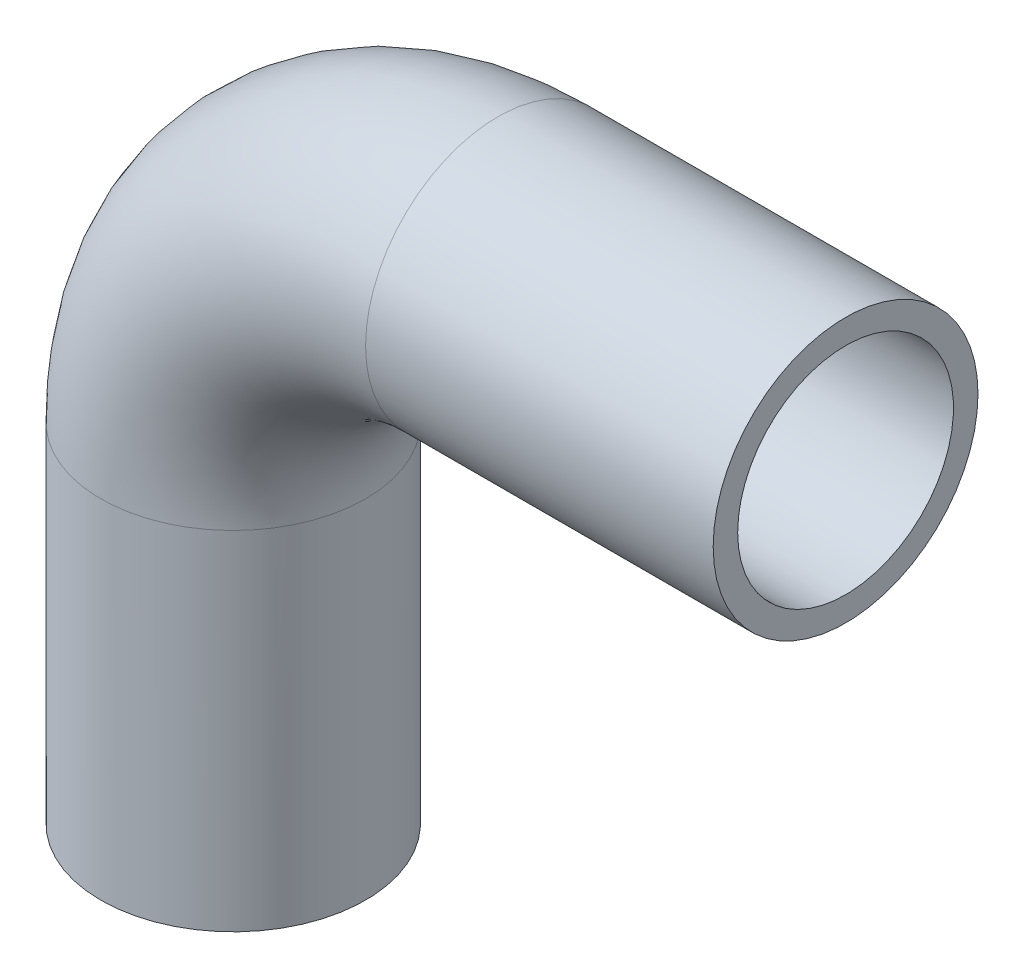
ISO-10303-21;
HEADER;
FILE_DESCRIPTION(('STEP AP214'),'2;1');
FILE_NAME('part.step','',(''),(''),'','','');
FILE_SCHEMA(('AUTOMOTIVE_DESIGN { 1 0 10303 214 1 1 1 1 }'));
ENDSEC;
DATA;
#1=APPLICATION_CONTEXT('core data for automotive mechanical design processes');
#2=APPLICATION_PROTOCOL_DEFINITION('international standard','automotive_design',2000,#1);
#3=PRODUCT_CONTEXT('',#1,'mechanical');
#4=PRODUCT('Part','Part','',(#3));
#5=PRODUCT_RELATED_PRODUCT_CATEGORY('part','',(#4));
#6=PRODUCT_DEFINITION_FORMATION('','',#4);
#7=PRODUCT_DEFINITION_CONTEXT('part definition',#1,'design');
#8=PRODUCT_DEFINITION('design','',#6,#7);
#9=PRODUCT_DEFINITION_SHAPE('','',#8);
#10=(LENGTH_UNIT() NAMED_UNIT(*) SI_UNIT(.MILLI.,.METRE.));
#11=(NAMED_UNIT(*) PLANE_ANGLE_UNIT() SI_UNIT($,.RADIAN.));
#12=(NAMED_UNIT(*) SI_UNIT($,.STERADIAN.) SOLID_ANGLE_UNIT());
#13=UNCERTAINTY_MEASURE_WITH_UNIT(LENGTH_MEASURE(1.E-05),#10,'distance_accuracy_value','');
#14=(GEOMETRIC_REPRESENTATION_CONTEXT(3) GLOBAL_UNCERTAINTY_ASSIGNED_CONTEXT((#13)) GLOBAL_UNIT_ASSIGNED_CONTEXT((#10,
#11,#12)) REPRESENTATION_CONTEXT('',''));
#15=CARTESIAN_POINT('',(0.,0.,0.));
#16=DIRECTION('',(0.,0.,1.));
#17=DIRECTION('',(1.,0.,0.));
#18=AXIS2_PLACEMENT_3D('',#15,#16,#17);
#19=CARTESIAN_POINT('',(40.,52.5,0.));
#20=DIRECTION('',(0.,0.,1.));
#21=DIRECTION('',(1.,0.,0.));
#22=AXIS2_PLACEMENT_3D('',#19,#20,#21);
#23=TOROIDAL_SURFACE('',#22,40.,16.3);
#24=CARTESIAN_POINT('',(40.,92.5,0.));
#25=DIRECTION('',(-1.,0.,0.));
#26=DIRECTION('',(0.,1.,0.));
#27=AXIS2_PLACEMENT_3D('',#24,#25,#26);
#28=CIRCLE('',#27,16.3);
#29=CARTESIAN_POINT('',(40.,108.8,0.));
#30=VERTEX_POINT('',#29);
#31=EDGE_CURVE('E33',#30,#30,#28,.T.);
#32=ORIENTED_EDGE('',*,*,#31,.F.);
#33=EDGE_LOOP('',(#32));
#34=FACE_BOUND('',#33,.T.);
#35=CARTESIAN_POINT('',(0.,52.5,0.));
#36=DIRECTION('',(0.,-1.,0.));
#37=DIRECTION('',(-1.,0.,0.));
#38=AXIS2_PLACEMENT_3D('',#35,#36,#37);
#39=CIRCLE('',#38,16.3);
#40=CARTESIAN_POINT('',(-16.3,52.5,0.));
#41=VERTEX_POINT('',#40);
#42=EDGE_CURVE('E31',#41,#41,#39,.F.);
#43=ORIENTED_EDGE('',*,*,#42,.F.);
#44=EDGE_LOOP('',(#43));
#45=FACE_BOUND('',#44,.T.);
#46=ADVANCED_FACE('F13',(#34,#45),#23,.F.);
#47=CARTESIAN_POINT('',(92.5,92.5,0.));
#48=DIRECTION('',(-1.,0.,0.));
#49=DIRECTION('',(0.,0.,1.));
#50=AXIS2_PLACEMENT_3D('',#47,#48,#49);
#51=CYLINDRICAL_SURFACE('',#50,16.3);
#52=CARTESIAN_POINT('',(92.5,92.5,0.));
#53=DIRECTION('',(-1.,0.,0.));
#54=DIRECTION('',(0.,0.,1.));
#55=AXIS2_PLACEMENT_3D('',#52,#53,#54);
#56=CIRCLE('',#55,16.3);
#57=CARTESIAN_POINT('',(92.5,92.5,16.3));
#58=VERTEX_POINT('',#57);
#59=EDGE_CURVE('E17',#58,#58,#56,.T.);
#60=ORIENTED_EDGE('',*,*,#59,.F.);
#61=EDGE_LOOP('',(#60));
#62=FACE_BOUND('',#61,.T.);
#63=ORIENTED_EDGE('',*,*,#31,.T.);
#64=EDGE_LOOP('',(#63));
#65=FACE_BOUND('',#64,.T.);
#66=ADVANCED_FACE('F52',(#62,#65),#51,.F.);
#67=CARTESIAN_POINT('',(0.,52.5,0.));
#68=DIRECTION('',(0.,-1.,0.));
#69=DIRECTION('',(0.,0.,-1.));
#70=AXIS2_PLACEMENT_3D('',#67,#68,#69);
#71=CYLINDRICAL_SURFACE('',#70,16.3);
#72=ORIENTED_EDGE('',*,*,#42,.T.);
#73=EDGE_LOOP('',(#72));
#74=FACE_BOUND('',#73,.T.);
#75=CARTESIAN_POINT('',(0.,0.,0.));
#76=DIRECTION('',(0.,-1.,0.));
#77=DIRECTION('',(0.,0.,-1.));
#78=AXIS2_PLACEMENT_3D('',#75,#76,#77);
#79=CIRCLE('',#78,16.3);
#80=CARTESIAN_POINT('',(0.,0.,-16.3));
#81=VERTEX_POINT('',#80);
#82=EDGE_CURVE('E42',#81,#81,#79,.F.);
#83=ORIENTED_EDGE('',*,*,#82,.F.);
#84=EDGE_LOOP('',(#83));
#85=FACE_BOUND('',#84,.T.);
#86=ADVANCED_FACE('F55',(#74,#85),#71,.F.);
#87=CARTESIAN_POINT('',(92.5,112.5,20.2400021082673));
#88=DIRECTION('',(1.,0.,0.));
#89=DIRECTION('',(0.,-1.,0.));
#90=AXIS2_PLACEMENT_3D('',#87,#88,#89);
#91=PLANE('',#90);
#92=ORIENTED_EDGE('',*,*,#59,.T.);
#93=EDGE_LOOP('',(#92));
#94=FACE_BOUND('',#93,.T.);
#95=CARTESIAN_POINT('',(92.5,92.5,0.));
#96=DIRECTION('',(-1.,0.,0.));
#97=DIRECTION('',(0.,0.,1.));
#98=AXIS2_PLACEMENT_3D('',#95,#96,#97);
#99=CIRCLE('',#98,20.);
#100=CARTESIAN_POINT('',(92.5,92.5,20.));
#101=VERTEX_POINT('',#100);
#102=EDGE_CURVE('E40',#101,#101,#99,.T.);
#103=ORIENTED_EDGE('',*,*,#102,.F.);
#104=EDGE_LOOP('',(#103));
#105=FACE_BOUND('',#104,.T.);
#106=ADVANCED_FACE('F49',(#94,#105),#91,.T.);
#107=CARTESIAN_POINT('',(20.,0.,20.2400021084628));
#108=DIRECTION('',(0.,-1.,0.));
#109=DIRECTION('',(-1.,0.,0.));
#110=AXIS2_PLACEMENT_3D('',#107,#108,#109);
#111=PLANE('',#110);
#112=ORIENTED_EDGE('',*,*,#82,.T.);
#113=EDGE_LOOP('',(#112));
#114=FACE_BOUND('',#113,.T.);
#115=CARTESIAN_POINT('',(0.,0.,0.));
#116=DIRECTION('',(0.,-1.,0.));
#117=DIRECTION('',(0.,0.,-1.));
#118=AXIS2_PLACEMENT_3D('',#115,#116,#117);
#119=CIRCLE('',#118,20.);
#120=CARTESIAN_POINT('',(0.,0.,-20.));
#121=VERTEX_POINT('',#120);
#122=EDGE_CURVE('E26',#121,#121,#119,.F.);
#123=ORIENTED_EDGE('',*,*,#122,.F.);
#124=EDGE_LOOP('',(#123));
#125=FACE_BOUND('',#124,.T.);
#126=ADVANCED_FACE('F69',(#114,#125),#111,.T.);
#127=CARTESIAN_POINT('',(40.,92.5,0.));
#128=DIRECTION('',(-1.,0.,0.));
#129=DIRECTION('',(0.,0.,1.));
#130=AXIS2_PLACEMENT_3D('',#127,#128,#129);
#131=CYLINDRICAL_SURFACE('',#130,20.);
#132=ORIENTED_EDGE('',*,*,#102,.T.);
#133=EDGE_LOOP('',(#132));
#134=FACE_BOUND('',#133,.T.);
#135=CARTESIAN_POINT('',(40.,92.5,0.));
#136=DIRECTION('',(-1.,0.,0.));
#137=DIRECTION('',(0.,-1.,0.));
#138=AXIS2_PLACEMENT_3D('',#135,#136,#137);
#139=CIRCLE('',#138,20.);
#140=CARTESIAN_POINT('',(40.,72.5,0.));
#141=VERTEX_POINT('',#140);
#142=EDGE_CURVE('E21',#141,#141,#139,.T.);
#143=ORIENTED_EDGE('',*,*,#142,.F.);
#144=EDGE_LOOP('',(#143));
#145=FACE_BOUND('',#144,.T.);
#146=ADVANCED_FACE('F79',(#134,#145),#131,.T.);
#147=CARTESIAN_POINT('',(0.,0.,0.));
#148=DIRECTION('',(0.,-1.,0.));
#149=DIRECTION('',(0.,0.,-1.));
#150=AXIS2_PLACEMENT_3D('',#147,#148,#149);
#151=CYLINDRICAL_SURFACE('',#150,20.);
#152=CARTESIAN_POINT('',(0.,52.5,0.));
#153=DIRECTION('',(0.,-1.,0.));
#154=DIRECTION('',(1.,0.,0.));
#155=AXIS2_PLACEMENT_3D('',#152,#153,#154);
#156=CIRCLE('',#155,20.);
#157=CARTESIAN_POINT('',(20.,52.5,0.));
#158=VERTEX_POINT('',#157);
#159=EDGE_CURVE('E8',#158,#158,#156,.F.);
#160=ORIENTED_EDGE('',*,*,#159,.F.);
#161=EDGE_LOOP('',(#160));
#162=FACE_BOUND('',#161,.T.);
#163=ORIENTED_EDGE('',*,*,#122,.T.);
#164=EDGE_LOOP('',(#163));
#165=FACE_BOUND('',#164,.T.);
#166=ADVANCED_FACE('F73',(#162,#165),#151,.T.);
#167=CARTESIAN_POINT('',(40.,52.5,0.));
#168=DIRECTION('',(0.,0.,1.));
#169=DIRECTION('',(1.,0.,0.));
#170=AXIS2_PLACEMENT_3D('',#167,#168,#169);
#171=TOROIDAL_SURFACE('',#170,40.,20.);
#172=ORIENTED_EDGE('',*,*,#142,.T.);
#173=EDGE_LOOP('',(#172));
#174=FACE_BOUND('',#173,.T.);
#175=ORIENTED_EDGE('',*,*,#159,.T.);
#176=EDGE_LOOP('',(#175));
#177=FACE_BOUND('',#176,.T.);
#178=ADVANCED_FACE('F71',(#174,#177),#171,.T.);
#179=CLOSED_SHELL('',(#46,#66,#86,#106,#126,#146,#166,#178));
#180=MANIFOLD_SOLID_BREP('B1',#179);
#181=ADVANCED_BREP_SHAPE_REPRESENTATION('',(#18,#180),#14);
#182=SHAPE_DEFINITION_REPRESENTATION(#9,#181);
ENDSEC;
END-ISO-10303-21;
